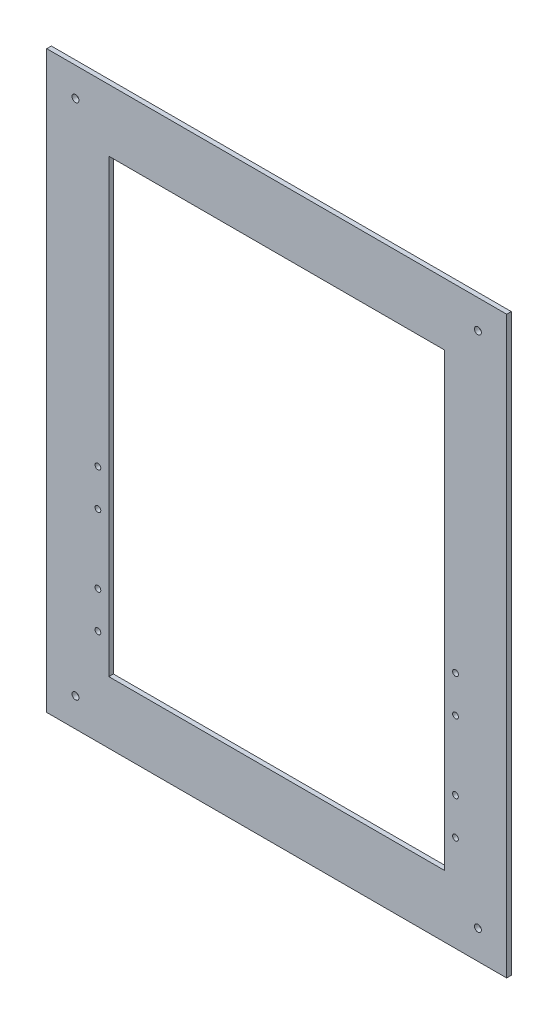
ISO-10303-21;
HEADER;
FILE_DESCRIPTION(('STEP AP214'),'2;1');
FILE_NAME('part.step','',(''),(''),'','','');
FILE_SCHEMA(('AUTOMOTIVE_DESIGN { 1 0 10303 214 1 1 1 1 }'));
ENDSEC;
DATA;
#1=APPLICATION_CONTEXT('core data for automotive mechanical design processes');
#2=APPLICATION_PROTOCOL_DEFINITION('international standard','automotive_design',2000,#1);
#3=PRODUCT_CONTEXT('',#1,'mechanical');
#4=PRODUCT('Part','Part','',(#3));
#5=PRODUCT_RELATED_PRODUCT_CATEGORY('part','',(#4));
#6=PRODUCT_DEFINITION_FORMATION('','',#4);
#7=PRODUCT_DEFINITION_CONTEXT('part definition',#1,'design');
#8=PRODUCT_DEFINITION('design','',#6,#7);
#9=PRODUCT_DEFINITION_SHAPE('','',#8);
#10=(LENGTH_UNIT() NAMED_UNIT(*) SI_UNIT(.MILLI.,.METRE.));
#11=(NAMED_UNIT(*) PLANE_ANGLE_UNIT() SI_UNIT($,.RADIAN.));
#12=(NAMED_UNIT(*) SI_UNIT($,.STERADIAN.) SOLID_ANGLE_UNIT());
#13=UNCERTAINTY_MEASURE_WITH_UNIT(LENGTH_MEASURE(1.E-05),#10,'distance_accuracy_value','');
#14=(GEOMETRIC_REPRESENTATION_CONTEXT(3) GLOBAL_UNCERTAINTY_ASSIGNED_CONTEXT((#13)) GLOBAL_UNIT_ASSIGNED_CONTEXT((#10,
#11,#12)) REPRESENTATION_CONTEXT('',''));
#15=CARTESIAN_POINT('',(0.,0.,0.));
#16=DIRECTION('',(0.,0.,1.));
#17=DIRECTION('',(1.,0.,0.));
#18=AXIS2_PLACEMENT_3D('',#15,#16,#17);
#19=CARTESIAN_POINT('',(0.,0.,4.));
#20=DIRECTION('',(0.,0.,-1.));
#21=DIRECTION('',(-1.,0.,0.));
#22=AXIS2_PLACEMENT_3D('',#19,#20,#21);
#23=PLANE('',#22);
#24=CARTESIAN_POINT('',(25.,475.,4.));
#25=DIRECTION('',(0.,0.,1.));
#26=DIRECTION('',(1.,0.,0.));
#27=AXIS2_PLACEMENT_3D('',#24,#25,#26);
#28=CIRCLE('',#27,2.99999999999999);
#29=CARTESIAN_POINT('',(28.,475.,4.));
#30=VERTEX_POINT('',#29);
#31=EDGE_CURVE('E274',#30,#30,#28,.F.);
#32=ORIENTED_EDGE('',*,*,#31,.T.);
#33=EDGE_LOOP('',(#32));
#34=FACE_BOUND('',#33,.T.);
#35=CARTESIAN_POINT('',(375.000000000001,475.,4.));
#36=DIRECTION('',(0.,0.,1.));
#37=DIRECTION('',(1.,0.,0.));
#38=AXIS2_PLACEMENT_3D('',#35,#36,#37);
#39=CIRCLE('',#38,2.99999999999999);
#40=CARTESIAN_POINT('',(378.000000000001,475.,4.));
#41=VERTEX_POINT('',#40);
#42=EDGE_CURVE('E268',#41,#41,#39,.T.);
#43=ORIENTED_EDGE('',*,*,#42,.F.);
#44=EDGE_LOOP('',(#43));
#45=FACE_BOUND('',#44,.T.);
#46=CARTESIAN_POINT('',(44.4999999999999,175.5,4.));
#47=DIRECTION('',(0.,0.,-1.));
#48=DIRECTION('',(-1.,0.,0.));
#49=AXIS2_PLACEMENT_3D('',#46,#47,#48);
#50=CIRCLE('',#49,2.50000000000002);
#51=CARTESIAN_POINT('',(41.9999999999999,175.5,4.));
#52=VERTEX_POINT('',#51);
#53=EDGE_CURVE('E258',#52,#52,#50,.T.);
#54=ORIENTED_EDGE('',*,*,#53,.T.);
#55=EDGE_LOOP('',(#54));
#56=FACE_BOUND('',#55,.T.);
#57=CARTESIAN_POINT('',(44.4999999999999,83.5,4.));
#58=DIRECTION('',(0.,0.,-1.));
#59=DIRECTION('',(-1.,0.,0.));
#60=AXIS2_PLACEMENT_3D('',#57,#58,#59);
#61=CIRCLE('',#60,2.50000000000002);
#62=CARTESIAN_POINT('',(41.9999999999999,83.5,4.));
#63=VERTEX_POINT('',#62);
#64=EDGE_CURVE('E246',#63,#63,#61,.T.);
#65=ORIENTED_EDGE('',*,*,#64,.T.);
#66=EDGE_LOOP('',(#65));
#67=FACE_BOUND('',#66,.T.);
#68=CARTESIAN_POINT('',(355.5,207.5,4.));
#69=DIRECTION('',(0.,0.,1.));
#70=DIRECTION('',(1.,0.,0.));
#71=AXIS2_PLACEMENT_3D('',#68,#69,#70);
#72=CIRCLE('',#71,2.50000000000002);
#73=CARTESIAN_POINT('',(358.,207.5,4.));
#74=VERTEX_POINT('',#73);
#75=EDGE_CURVE('E240',#74,#74,#72,.T.);
#76=ORIENTED_EDGE('',*,*,#75,.F.);
#77=EDGE_LOOP('',(#76));
#78=FACE_BOUND('',#77,.T.);
#79=CARTESIAN_POINT('',(355.5,175.5,4.));
#80=DIRECTION('',(0.,0.,1.));
#81=DIRECTION('',(1.,0.,0.));
#82=AXIS2_PLACEMENT_3D('',#79,#80,#81);
#83=CIRCLE('',#82,2.50000000000002);
#84=CARTESIAN_POINT('',(358.,175.5,4.));
#85=VERTEX_POINT('',#84);
#86=EDGE_CURVE('E234',#85,#85,#83,.T.);
#87=ORIENTED_EDGE('',*,*,#86,.F.);
#88=EDGE_LOOP('',(#87));
#89=FACE_BOUND('',#88,.T.);
#90=CARTESIAN_POINT('',(355.5,115.5,4.));
#91=DIRECTION('',(0.,0.,1.));
#92=DIRECTION('',(1.,0.,0.));
#93=AXIS2_PLACEMENT_3D('',#90,#91,#92);
#94=CIRCLE('',#93,2.50000000000002);
#95=CARTESIAN_POINT('',(358.,115.5,4.));
#96=VERTEX_POINT('',#95);
#97=EDGE_CURVE('E228',#96,#96,#94,.T.);
#98=ORIENTED_EDGE('',*,*,#97,.F.);
#99=EDGE_LOOP('',(#98));
#100=FACE_BOUND('',#99,.T.);
#101=CARTESIAN_POINT('',(355.5,83.5,4.));
#102=DIRECTION('',(0.,0.,1.));
#103=DIRECTION('',(1.,0.,0.));
#104=AXIS2_PLACEMENT_3D('',#101,#102,#103);
#105=CIRCLE('',#104,2.50000000000002);
#106=CARTESIAN_POINT('',(358.,83.5,4.));
#107=VERTEX_POINT('',#106);
#108=EDGE_CURVE('E125',#107,#107,#105,.T.);
#109=ORIENTED_EDGE('',*,*,#108,.F.);
#110=EDGE_LOOP('',(#109));
#111=FACE_BOUND('',#110,.T.);
#112=DIRECTION('',(0.,1.,0.));
#113=VECTOR('',#112,1.);
#114=CARTESIAN_POINT('',(346.,446.,4.));
#115=LINE('',#114,#113);
#116=CARTESIAN_POINT('',(346.,54.,4.));
#117=VERTEX_POINT('',#116);
#118=CARTESIAN_POINT('',(346.,446.,4.));
#119=VERTEX_POINT('',#118);
#120=EDGE_CURVE('E48',#117,#119,#115,.T.);
#121=ORIENTED_EDGE('',*,*,#120,.F.);
#122=DIRECTION('',(1.,0.,0.));
#123=VECTOR('',#122,1.);
#124=CARTESIAN_POINT('',(54.,54.,4.));
#125=LINE('',#124,#123);
#126=CARTESIAN_POINT('',(54.,54.,4.));
#127=VERTEX_POINT('',#126);
#128=EDGE_CURVE('E214',#127,#117,#125,.T.);
#129=ORIENTED_EDGE('',*,*,#128,.F.);
#130=DIRECTION('',(0.,-1.,0.));
#131=VECTOR('',#130,1.);
#132=CARTESIAN_POINT('',(54.,446.,4.));
#133=LINE('',#132,#131);
#134=CARTESIAN_POINT('',(54.,446.,4.));
#135=VERTEX_POINT('',#134);
#136=EDGE_CURVE('E116',#135,#127,#133,.T.);
#137=ORIENTED_EDGE('',*,*,#136,.F.);
#138=DIRECTION('',(-1.,0.,0.));
#139=VECTOR('',#138,1.);
#140=CARTESIAN_POINT('',(54.,446.,4.));
#141=LINE('',#140,#139);
#142=EDGE_CURVE('E133',#119,#135,#141,.T.);
#143=ORIENTED_EDGE('',*,*,#142,.F.);
#144=EDGE_LOOP('',(#121,#129,#137,#143));
#145=FACE_BOUND('',#144,.T.);
#146=DIRECTION('',(0.,-1.,0.));
#147=VECTOR('',#146,1.);
#148=CARTESIAN_POINT('',(0.,0.,4.));
#149=LINE('',#148,#147);
#150=CARTESIAN_POINT('',(0.,500.,4.));
#151=VERTEX_POINT('',#150);
#152=CARTESIAN_POINT('',(0.,0.,4.));
#153=VERTEX_POINT('',#152);
#154=EDGE_CURVE('E134',#151,#153,#149,.T.);
#155=ORIENTED_EDGE('',*,*,#154,.T.);
#156=DIRECTION('',(1.,0.,0.));
#157=VECTOR('',#156,1.);
#158=CARTESIAN_POINT('',(0.,0.,4.));
#159=LINE('',#158,#157);
#160=CARTESIAN_POINT('',(400.,0.,4.));
#161=VERTEX_POINT('',#160);
#162=EDGE_CURVE('E137',#153,#161,#159,.T.);
#163=ORIENTED_EDGE('',*,*,#162,.T.);
#164=DIRECTION('',(0.,1.,0.));
#165=VECTOR('',#164,1.);
#166=CARTESIAN_POINT('',(400.,0.,4.));
#167=LINE('',#166,#165);
#168=CARTESIAN_POINT('',(400.,500.,4.));
#169=VERTEX_POINT('',#168);
#170=EDGE_CURVE('E140',#161,#169,#167,.T.);
#171=ORIENTED_EDGE('',*,*,#170,.T.);
#172=DIRECTION('',(-1.,0.,0.));
#173=VECTOR('',#172,1.);
#174=CARTESIAN_POINT('',(0.,500.,4.));
#175=LINE('',#174,#173);
#176=EDGE_CURVE('E142',#169,#151,#175,.T.);
#177=ORIENTED_EDGE('',*,*,#176,.T.);
#178=EDGE_LOOP('',(#155,#163,#171,#177));
#179=FACE_BOUND('',#178,.T.);
#180=CARTESIAN_POINT('',(44.4999999999999,115.5,4.));
#181=DIRECTION('',(0.,0.,-1.));
#182=DIRECTION('',(-1.,0.,0.));
#183=AXIS2_PLACEMENT_3D('',#180,#181,#182);
#184=CIRCLE('',#183,2.50000000000002);
#185=CARTESIAN_POINT('',(41.9999999999999,115.5,4.));
#186=VERTEX_POINT('',#185);
#187=EDGE_CURVE('E252',#186,#186,#184,.T.);
#188=ORIENTED_EDGE('',*,*,#187,.T.);
#189=EDGE_LOOP('',(#188));
#190=FACE_BOUND('',#189,.T.);
#191=CARTESIAN_POINT('',(44.4999999999999,207.5,4.));
#192=DIRECTION('',(0.,0.,-1.));
#193=DIRECTION('',(-1.,0.,0.));
#194=AXIS2_PLACEMENT_3D('',#191,#192,#193);
#195=CIRCLE('',#194,2.50000000000002);
#196=CARTESIAN_POINT('',(41.9999999999999,207.5,4.));
#197=VERTEX_POINT('',#196);
#198=EDGE_CURVE('E264',#197,#197,#195,.T.);
#199=ORIENTED_EDGE('',*,*,#198,.T.);
#200=EDGE_LOOP('',(#199));
#201=FACE_BOUND('',#200,.T.);
#202=CARTESIAN_POINT('',(25.,25.,4.));
#203=DIRECTION('',(0.,0.,1.));
#204=DIRECTION('',(1.,0.,0.));
#205=AXIS2_PLACEMENT_3D('',#202,#203,#204);
#206=CIRCLE('',#205,2.99999999999999);
#207=CARTESIAN_POINT('',(28.,25.,4.));
#208=VERTEX_POINT('',#207);
#209=EDGE_CURVE('E279',#208,#208,#206,.T.);
#210=ORIENTED_EDGE('',*,*,#209,.F.);
#211=EDGE_LOOP('',(#210));
#212=FACE_BOUND('',#211,.T.);
#213=CARTESIAN_POINT('',(375.,24.9999999999996,4.));
#214=DIRECTION('',(0.,0.,1.));
#215=DIRECTION('',(1.,0.,0.));
#216=AXIS2_PLACEMENT_3D('',#213,#214,#215);
#217=CIRCLE('',#216,2.99999999999999);
#218=CARTESIAN_POINT('',(378.,24.9999999999996,4.));
#219=VERTEX_POINT('',#218);
#220=EDGE_CURVE('E285',#219,#219,#217,.F.);
#221=ORIENTED_EDGE('',*,*,#220,.T.);
#222=EDGE_LOOP('',(#221));
#223=FACE_BOUND('',#222,.T.);
#224=ADVANCED_FACE('F33',(#34,#45,#56,#67,#78,#89,#100,#111,#145,#179,#190,#201,#212,#223),#23,.F.);
#225=CARTESIAN_POINT('',(0.,0.,0.));
#226=DIRECTION('',(0.,0.,-1.));
#227=DIRECTION('',(-1.,0.,0.));
#228=AXIS2_PLACEMENT_3D('',#225,#226,#227);
#229=PLANE('',#228);
#230=CARTESIAN_POINT('',(25.,475.,0.));
#231=DIRECTION('',(0.,0.,1.));
#232=DIRECTION('',(1.,0.,0.));
#233=AXIS2_PLACEMENT_3D('',#230,#231,#232);
#234=CIRCLE('',#233,2.99999999999999);
#235=CARTESIAN_POINT('',(28.,475.,0.));
#236=VERTEX_POINT('',#235);
#237=EDGE_CURVE('E271',#236,#236,#234,.F.);
#238=ORIENTED_EDGE('',*,*,#237,.F.);
#239=EDGE_LOOP('',(#238));
#240=FACE_BOUND('',#239,.T.);
#241=CARTESIAN_POINT('',(375.000000000001,475.,0.));
#242=DIRECTION('',(0.,0.,1.));
#243=DIRECTION('',(1.,0.,0.));
#244=AXIS2_PLACEMENT_3D('',#241,#242,#243);
#245=CIRCLE('',#244,2.99999999999999);
#246=CARTESIAN_POINT('',(378.000000000001,475.,0.));
#247=VERTEX_POINT('',#246);
#248=EDGE_CURVE('E267',#247,#247,#245,.T.);
#249=ORIENTED_EDGE('',*,*,#248,.T.);
#250=EDGE_LOOP('',(#249));
#251=FACE_BOUND('',#250,.T.);
#252=CARTESIAN_POINT('',(44.4999999999999,175.5,0.));
#253=DIRECTION('',(0.,0.,-1.));
#254=DIRECTION('',(-1.,0.,0.));
#255=AXIS2_PLACEMENT_3D('',#252,#253,#254);
#256=CIRCLE('',#255,2.50000000000002);
#257=CARTESIAN_POINT('',(41.9999999999999,175.5,0.));
#258=VERTEX_POINT('',#257);
#259=EDGE_CURVE('E255',#258,#258,#256,.T.);
#260=ORIENTED_EDGE('',*,*,#259,.F.);
#261=EDGE_LOOP('',(#260));
#262=FACE_BOUND('',#261,.T.);
#263=CARTESIAN_POINT('',(44.4999999999999,83.5,0.));
#264=DIRECTION('',(0.,0.,-1.));
#265=DIRECTION('',(-1.,0.,0.));
#266=AXIS2_PLACEMENT_3D('',#263,#264,#265);
#267=CIRCLE('',#266,2.50000000000002);
#268=CARTESIAN_POINT('',(41.9999999999999,83.5,0.));
#269=VERTEX_POINT('',#268);
#270=EDGE_CURVE('E243',#269,#269,#267,.T.);
#271=ORIENTED_EDGE('',*,*,#270,.F.);
#272=EDGE_LOOP('',(#271));
#273=FACE_BOUND('',#272,.T.);
#274=CARTESIAN_POINT('',(355.5,207.5,0.));
#275=DIRECTION('',(0.,0.,-1.));
#276=DIRECTION('',(-1.,0.,0.));
#277=AXIS2_PLACEMENT_3D('',#274,#275,#276);
#278=CIRCLE('',#277,2.50000000000002);
#279=CARTESIAN_POINT('',(353.,207.5,0.));
#280=VERTEX_POINT('',#279);
#281=EDGE_CURVE('E237',#280,#280,#278,.F.);
#282=ORIENTED_EDGE('',*,*,#281,.T.);
#283=EDGE_LOOP('',(#282));
#284=FACE_BOUND('',#283,.T.);
#285=CARTESIAN_POINT('',(355.5,175.5,0.));
#286=DIRECTION('',(0.,0.,-1.));
#287=DIRECTION('',(-1.,0.,0.));
#288=AXIS2_PLACEMENT_3D('',#285,#286,#287);
#289=CIRCLE('',#288,2.50000000000002);
#290=CARTESIAN_POINT('',(353.,175.5,0.));
#291=VERTEX_POINT('',#290);
#292=EDGE_CURVE('E231',#291,#291,#289,.F.);
#293=ORIENTED_EDGE('',*,*,#292,.T.);
#294=EDGE_LOOP('',(#293));
#295=FACE_BOUND('',#294,.T.);
#296=CARTESIAN_POINT('',(355.5,115.5,0.));
#297=DIRECTION('',(0.,0.,-1.));
#298=DIRECTION('',(-1.,0.,0.));
#299=AXIS2_PLACEMENT_3D('',#296,#297,#298);
#300=CIRCLE('',#299,2.50000000000002);
#301=CARTESIAN_POINT('',(353.,115.5,0.));
#302=VERTEX_POINT('',#301);
#303=EDGE_CURVE('E225',#302,#302,#300,.F.);
#304=ORIENTED_EDGE('',*,*,#303,.T.);
#305=EDGE_LOOP('',(#304));
#306=FACE_BOUND('',#305,.T.);
#307=CARTESIAN_POINT('',(355.5,83.5,0.));
#308=DIRECTION('',(0.,0.,-1.));
#309=DIRECTION('',(-1.,0.,0.));
#310=AXIS2_PLACEMENT_3D('',#307,#308,#309);
#311=CIRCLE('',#310,2.50000000000002);
#312=CARTESIAN_POINT('',(353.,83.5,0.));
#313=VERTEX_POINT('',#312);
#314=EDGE_CURVE('E122',#313,#313,#311,.F.);
#315=ORIENTED_EDGE('',*,*,#314,.T.);
#316=EDGE_LOOP('',(#315));
#317=FACE_BOUND('',#316,.T.);
#318=DIRECTION('',(1.,0.,0.));
#319=VECTOR('',#318,1.);
#320=CARTESIAN_POINT('',(54.,54.,0.));
#321=LINE('',#320,#319);
#322=CARTESIAN_POINT('',(54.,54.,-1.13686837721616E-10));
#323=VERTEX_POINT('',#322);
#324=CARTESIAN_POINT('',(346.,54.,-1.13686837721616E-10));
#325=VERTEX_POINT('',#324);
#326=EDGE_CURVE('E99',#323,#325,#321,.T.);
#327=ORIENTED_EDGE('',*,*,#326,.T.);
#328=DIRECTION('',(0.,1.,0.));
#329=VECTOR('',#328,1.);
#330=CARTESIAN_POINT('',(346.,446.,0.));
#331=LINE('',#330,#329);
#332=CARTESIAN_POINT('',(346.,446.,-1.13686837721616E-10));
#333=VERTEX_POINT('',#332);
#334=EDGE_CURVE('E109',#325,#333,#331,.T.);
#335=ORIENTED_EDGE('',*,*,#334,.T.);
#336=DIRECTION('',(-1.,0.,0.));
#337=VECTOR('',#336,1.);
#338=CARTESIAN_POINT('',(54.,446.,0.));
#339=LINE('',#338,#337);
#340=CARTESIAN_POINT('',(54.,446.,0.));
#341=VERTEX_POINT('',#340);
#342=EDGE_CURVE('E118',#333,#341,#339,.T.);
#343=ORIENTED_EDGE('',*,*,#342,.T.);
#344=DIRECTION('',(0.,-1.,0.));
#345=VECTOR('',#344,1.);
#346=CARTESIAN_POINT('',(54.,446.,0.));
#347=LINE('',#346,#345);
#348=EDGE_CURVE('E110',#341,#323,#347,.T.);
#349=ORIENTED_EDGE('',*,*,#348,.T.);
#350=EDGE_LOOP('',(#327,#335,#343,#349));
#351=FACE_BOUND('',#350,.T.);
#352=DIRECTION('',(0.,-1.,0.));
#353=VECTOR('',#352,1.);
#354=CARTESIAN_POINT('',(0.,0.,0.));
#355=LINE('',#354,#353);
#356=CARTESIAN_POINT('',(0.,500.,0.));
#357=VERTEX_POINT('',#356);
#358=CARTESIAN_POINT('',(0.,0.,0.));
#359=VERTEX_POINT('',#358);
#360=EDGE_CURVE('E145',#357,#359,#355,.T.);
#361=ORIENTED_EDGE('',*,*,#360,.F.);
#362=DIRECTION('',(-1.,0.,0.));
#363=VECTOR('',#362,1.);
#364=CARTESIAN_POINT('',(0.,500.,0.));
#365=LINE('',#364,#363);
#366=CARTESIAN_POINT('',(400.,500.,0.));
#367=VERTEX_POINT('',#366);
#368=EDGE_CURVE('E138',#367,#357,#365,.T.);
#369=ORIENTED_EDGE('',*,*,#368,.F.);
#370=DIRECTION('',(0.,1.,0.));
#371=VECTOR('',#370,1.);
#372=CARTESIAN_POINT('',(400.,0.,0.));
#373=LINE('',#372,#371);
#374=CARTESIAN_POINT('',(400.,0.,0.));
#375=VERTEX_POINT('',#374);
#376=EDGE_CURVE('E150',#375,#367,#373,.T.);
#377=ORIENTED_EDGE('',*,*,#376,.F.);
#378=DIRECTION('',(1.,0.,0.));
#379=VECTOR('',#378,1.);
#380=CARTESIAN_POINT('',(0.,0.,0.));
#381=LINE('',#380,#379);
#382=EDGE_CURVE('E148',#359,#375,#381,.T.);
#383=ORIENTED_EDGE('',*,*,#382,.F.);
#384=EDGE_LOOP('',(#361,#369,#377,#383));
#385=FACE_BOUND('',#384,.T.);
#386=CARTESIAN_POINT('',(44.4999999999999,115.5,0.));
#387=DIRECTION('',(0.,0.,-1.));
#388=DIRECTION('',(-1.,0.,0.));
#389=AXIS2_PLACEMENT_3D('',#386,#387,#388);
#390=CIRCLE('',#389,2.50000000000002);
#391=CARTESIAN_POINT('',(41.9999999999999,115.5,0.));
#392=VERTEX_POINT('',#391);
#393=EDGE_CURVE('E249',#392,#392,#390,.T.);
#394=ORIENTED_EDGE('',*,*,#393,.F.);
#395=EDGE_LOOP('',(#394));
#396=FACE_BOUND('',#395,.T.);
#397=CARTESIAN_POINT('',(44.4999999999999,207.5,0.));
#398=DIRECTION('',(0.,0.,-1.));
#399=DIRECTION('',(-1.,0.,0.));
#400=AXIS2_PLACEMENT_3D('',#397,#398,#399);
#401=CIRCLE('',#400,2.50000000000002);
#402=CARTESIAN_POINT('',(41.9999999999999,207.5,0.));
#403=VERTEX_POINT('',#402);
#404=EDGE_CURVE('E261',#403,#403,#401,.T.);
#405=ORIENTED_EDGE('',*,*,#404,.F.);
#406=EDGE_LOOP('',(#405));
#407=FACE_BOUND('',#406,.T.);
#408=CARTESIAN_POINT('',(25.,25.,0.));
#409=DIRECTION('',(0.,0.,1.));
#410=DIRECTION('',(1.,0.,0.));
#411=AXIS2_PLACEMENT_3D('',#408,#409,#410);
#412=CIRCLE('',#411,2.99999999999999);
#413=CARTESIAN_POINT('',(28.,25.,0.));
#414=VERTEX_POINT('',#413);
#415=EDGE_CURVE('E276',#414,#414,#412,.T.);
#416=ORIENTED_EDGE('',*,*,#415,.T.);
#417=EDGE_LOOP('',(#416));
#418=FACE_BOUND('',#417,.T.);
#419=CARTESIAN_POINT('',(375.,24.9999999999996,0.));
#420=DIRECTION('',(0.,0.,1.));
#421=DIRECTION('',(1.,0.,0.));
#422=AXIS2_PLACEMENT_3D('',#419,#420,#421);
#423=CIRCLE('',#422,2.99999999999999);
#424=CARTESIAN_POINT('',(378.,24.9999999999996,0.));
#425=VERTEX_POINT('',#424);
#426=EDGE_CURVE('E282',#425,#425,#423,.F.);
#427=ORIENTED_EDGE('',*,*,#426,.F.);
#428=EDGE_LOOP('',(#427));
#429=FACE_BOUND('',#428,.T.);
#430=ADVANCED_FACE('F120',(#240,#251,#262,#273,#284,#295,#306,#317,#351,#385,#396,#407,#418,
#429),#229,.T.);
#431=CARTESIAN_POINT('',(0.,0.,4.));
#432=DIRECTION('',(1.,0.,0.));
#433=DIRECTION('',(0.,0.,-1.));
#434=AXIS2_PLACEMENT_3D('',#431,#432,#433);
#435=PLANE('',#434);
#436=ORIENTED_EDGE('',*,*,#360,.T.);
#437=DIRECTION('',(0.,0.,-1.));
#438=VECTOR('',#437,1.);
#439=CARTESIAN_POINT('',(0.,0.,4.));
#440=LINE('',#439,#438);
#441=EDGE_CURVE('E11',#153,#359,#440,.T.);
#442=ORIENTED_EDGE('',*,*,#441,.F.);
#443=ORIENTED_EDGE('',*,*,#154,.F.);
#444=DIRECTION('',(0.,0.,-1.));
#445=VECTOR('',#444,1.);
#446=CARTESIAN_POINT('',(0.,500.,4.));
#447=LINE('',#446,#445);
#448=EDGE_CURVE('E144',#151,#357,#447,.T.);
#449=ORIENTED_EDGE('',*,*,#448,.T.);
#450=EDGE_LOOP('',(#436,#442,#443,#449));
#451=FACE_BOUND('',#450,.T.);
#452=ADVANCED_FACE('F35',(#451),#435,.F.);
#453=CARTESIAN_POINT('',(0.,0.,4.));
#454=DIRECTION('',(0.,1.,0.));
#455=DIRECTION('',(0.,0.,1.));
#456=AXIS2_PLACEMENT_3D('',#453,#454,#455);
#457=PLANE('',#456);
#458=ORIENTED_EDGE('',*,*,#382,.T.);
#459=DIRECTION('',(0.,0.,-1.));
#460=VECTOR('',#459,1.);
#461=CARTESIAN_POINT('',(400.,0.,4.));
#462=LINE('',#461,#460);
#463=EDGE_CURVE('E41',#161,#375,#462,.T.);
#464=ORIENTED_EDGE('',*,*,#463,.F.);
#465=ORIENTED_EDGE('',*,*,#162,.F.);
#466=ORIENTED_EDGE('',*,*,#441,.T.);
#467=EDGE_LOOP('',(#458,#464,#465,#466));
#468=FACE_BOUND('',#467,.T.);
#469=ADVANCED_FACE('F177',(#468),#457,.F.);
#470=CARTESIAN_POINT('',(400.,0.,4.));
#471=DIRECTION('',(-1.,0.,0.));
#472=DIRECTION('',(0.,0.,1.));
#473=AXIS2_PLACEMENT_3D('',#470,#471,#472);
#474=PLANE('',#473);
#475=ORIENTED_EDGE('',*,*,#376,.T.);
#476=DIRECTION('',(0.,0.,-1.));
#477=VECTOR('',#476,1.);
#478=CARTESIAN_POINT('',(400.,500.,4.));
#479=LINE('',#478,#477);
#480=EDGE_CURVE('E155',#169,#367,#479,.T.);
#481=ORIENTED_EDGE('',*,*,#480,.F.);
#482=ORIENTED_EDGE('',*,*,#170,.F.);
#483=ORIENTED_EDGE('',*,*,#463,.T.);
#484=EDGE_LOOP('',(#475,#481,#482,#483));
#485=FACE_BOUND('',#484,.T.);
#486=ADVANCED_FACE('F162',(#485),#474,.F.);
#487=CARTESIAN_POINT('',(0.,500.,4.));
#488=DIRECTION('',(0.,-1.,0.));
#489=DIRECTION('',(0.,0.,-1.));
#490=AXIS2_PLACEMENT_3D('',#487,#488,#489);
#491=PLANE('',#490);
#492=ORIENTED_EDGE('',*,*,#368,.T.);
#493=ORIENTED_EDGE('',*,*,#448,.F.);
#494=ORIENTED_EDGE('',*,*,#176,.F.);
#495=ORIENTED_EDGE('',*,*,#480,.T.);
#496=EDGE_LOOP('',(#492,#493,#494,#495));
#497=FACE_BOUND('',#496,.T.);
#498=ADVANCED_FACE('F170',(#497),#491,.F.);
#499=CARTESIAN_POINT('',(54.,54.,-500000.));
#500=DIRECTION('',(0.,-1.,0.));
#501=DIRECTION('',(0.,0.,-1.));
#502=AXIS2_PLACEMENT_3D('',#499,#500,#501);
#503=PLANE('',#502);
#504=DIRECTION('',(0.,0.,1.));
#505=VECTOR('',#504,1.);
#506=CARTESIAN_POINT('',(54.,54.,-500000.));
#507=LINE('',#506,#505);
#508=EDGE_CURVE('E103',#323,#127,#507,.T.);
#509=ORIENTED_EDGE('',*,*,#508,.T.);
#510=ORIENTED_EDGE('',*,*,#128,.T.);
#511=DIRECTION('',(0.,0.,1.));
#512=VECTOR('',#511,1.);
#513=CARTESIAN_POINT('',(346.,54.,-500000.));
#514=LINE('',#513,#512);
#515=EDGE_CURVE('E105',#325,#117,#514,.T.);
#516=ORIENTED_EDGE('',*,*,#515,.F.);
#517=ORIENTED_EDGE('',*,*,#326,.F.);
#518=EDGE_LOOP('',(#509,#510,#516,#517));
#519=FACE_BOUND('',#518,.T.);
#520=ADVANCED_FACE('F101',(#519),#503,.F.);
#521=CARTESIAN_POINT('',(54.,446.,-500000.));
#522=DIRECTION('',(-1.,0.,0.));
#523=DIRECTION('',(0.,-1.,0.));
#524=AXIS2_PLACEMENT_3D('',#521,#522,#523);
#525=PLANE('',#524);
#526=DIRECTION('',(0.,0.,1.));
#527=VECTOR('',#526,1.);
#528=CARTESIAN_POINT('',(54.,446.,-500000.));
#529=LINE('',#528,#527);
#530=EDGE_CURVE('E56',#341,#135,#529,.T.);
#531=ORIENTED_EDGE('',*,*,#530,.T.);
#532=ORIENTED_EDGE('',*,*,#136,.T.);
#533=ORIENTED_EDGE('',*,*,#508,.F.);
#534=ORIENTED_EDGE('',*,*,#348,.F.);
#535=EDGE_LOOP('',(#531,#532,#533,#534));
#536=FACE_BOUND('',#535,.T.);
#537=ADVANCED_FACE('F113',(#536),#525,.F.);
#538=CARTESIAN_POINT('',(346.,446.,-500000.));
#539=DIRECTION('',(1.,0.,0.));
#540=DIRECTION('',(0.,1.,0.));
#541=AXIS2_PLACEMENT_3D('',#538,#539,#540);
#542=PLANE('',#541);
#543=ORIENTED_EDGE('',*,*,#515,.T.);
#544=ORIENTED_EDGE('',*,*,#120,.T.);
#545=DIRECTION('',(0.,0.,1.));
#546=VECTOR('',#545,1.);
#547=CARTESIAN_POINT('',(346.,446.,-500000.));
#548=LINE('',#547,#546);
#549=EDGE_CURVE('E130',#333,#119,#548,.T.);
#550=ORIENTED_EDGE('',*,*,#549,.F.);
#551=ORIENTED_EDGE('',*,*,#334,.F.);
#552=EDGE_LOOP('',(#543,#544,#550,#551));
#553=FACE_BOUND('',#552,.T.);
#554=ADVANCED_FACE('F206',(#553),#542,.F.);
#555=CARTESIAN_POINT('',(54.,446.,-500000.));
#556=DIRECTION('',(0.,1.,0.));
#557=DIRECTION('',(0.,0.,1.));
#558=AXIS2_PLACEMENT_3D('',#555,#556,#557);
#559=PLANE('',#558);
#560=ORIENTED_EDGE('',*,*,#549,.T.);
#561=ORIENTED_EDGE('',*,*,#142,.T.);
#562=ORIENTED_EDGE('',*,*,#530,.F.);
#563=ORIENTED_EDGE('',*,*,#342,.F.);
#564=EDGE_LOOP('',(#560,#561,#562,#563));
#565=FACE_BOUND('',#564,.T.);
#566=ADVANCED_FACE('F195',(#565),#559,.F.);
#567=CARTESIAN_POINT('',(355.5,83.5,-7.07106781186552));
#568=DIRECTION('',(0.,0.,1.));
#569=DIRECTION('',(1.,0.,0.));
#570=AXIS2_PLACEMENT_3D('',#567,#568,#569);
#571=CYLINDRICAL_SURFACE('',#570,2.50000000000002);
#572=ORIENTED_EDGE('',*,*,#108,.T.);
#573=EDGE_LOOP('',(#572));
#574=FACE_BOUND('',#573,.T.);
#575=ORIENTED_EDGE('',*,*,#314,.F.);
#576=EDGE_LOOP('',(#575));
#577=FACE_BOUND('',#576,.T.);
#578=ADVANCED_FACE('F213',(#574,#577),#571,.F.);
#579=CARTESIAN_POINT('',(355.5,115.5,-7.07106781186552));
#580=DIRECTION('',(0.,0.,1.));
#581=DIRECTION('',(1.,0.,0.));
#582=AXIS2_PLACEMENT_3D('',#579,#580,#581);
#583=CYLINDRICAL_SURFACE('',#582,2.50000000000002);
#584=ORIENTED_EDGE('',*,*,#97,.T.);
#585=EDGE_LOOP('',(#584));
#586=FACE_BOUND('',#585,.T.);
#587=ORIENTED_EDGE('',*,*,#303,.F.);
#588=EDGE_LOOP('',(#587));
#589=FACE_BOUND('',#588,.T.);
#590=ADVANCED_FACE('F336',(#586,#589),#583,.F.);
#591=CARTESIAN_POINT('',(355.5,175.5,-7.07106781186552));
#592=DIRECTION('',(0.,0.,1.));
#593=DIRECTION('',(1.,0.,0.));
#594=AXIS2_PLACEMENT_3D('',#591,#592,#593);
#595=CYLINDRICAL_SURFACE('',#594,2.50000000000002);
#596=ORIENTED_EDGE('',*,*,#86,.T.);
#597=EDGE_LOOP('',(#596));
#598=FACE_BOUND('',#597,.T.);
#599=ORIENTED_EDGE('',*,*,#292,.F.);
#600=EDGE_LOOP('',(#599));
#601=FACE_BOUND('',#600,.T.);
#602=ADVANCED_FACE('F332',(#598,#601),#595,.F.);
#603=CARTESIAN_POINT('',(355.5,207.5,-7.07106781186552));
#604=DIRECTION('',(0.,0.,1.));
#605=DIRECTION('',(1.,0.,0.));
#606=AXIS2_PLACEMENT_3D('',#603,#604,#605);
#607=CYLINDRICAL_SURFACE('',#606,2.50000000000002);
#608=ORIENTED_EDGE('',*,*,#75,.T.);
#609=EDGE_LOOP('',(#608));
#610=FACE_BOUND('',#609,.T.);
#611=ORIENTED_EDGE('',*,*,#281,.F.);
#612=EDGE_LOOP('',(#611));
#613=FACE_BOUND('',#612,.T.);
#614=ADVANCED_FACE('F328',(#610,#613),#607,.F.);
#615=CARTESIAN_POINT('',(44.4999999999999,83.5,-7.07106781186555));
#616=DIRECTION('',(0.,0.,1.));
#617=DIRECTION('',(1.,0.,0.));
#618=AXIS2_PLACEMENT_3D('',#615,#616,#617);
#619=CYLINDRICAL_SURFACE('',#618,2.50000000000002);
#620=ORIENTED_EDGE('',*,*,#64,.F.);
#621=EDGE_LOOP('',(#620));
#622=FACE_BOUND('',#621,.T.);
#623=ORIENTED_EDGE('',*,*,#270,.T.);
#624=EDGE_LOOP('',(#623));
#625=FACE_BOUND('',#624,.T.);
#626=ADVANCED_FACE('F324',(#622,#625),#619,.F.);
#627=CARTESIAN_POINT('',(44.4999999999999,115.5,-7.07106781186555));
#628=DIRECTION('',(0.,0.,1.));
#629=DIRECTION('',(1.,0.,0.));
#630=AXIS2_PLACEMENT_3D('',#627,#628,#629);
#631=CYLINDRICAL_SURFACE('',#630,2.50000000000002);
#632=ORIENTED_EDGE('',*,*,#187,.F.);
#633=EDGE_LOOP('',(#632));
#634=FACE_BOUND('',#633,.T.);
#635=ORIENTED_EDGE('',*,*,#393,.T.);
#636=EDGE_LOOP('',(#635));
#637=FACE_BOUND('',#636,.T.);
#638=ADVANCED_FACE('F320',(#634,#637),#631,.F.);
#639=CARTESIAN_POINT('',(44.4999999999999,175.5,-7.07106781186555));
#640=DIRECTION('',(0.,0.,1.));
#641=DIRECTION('',(1.,0.,0.));
#642=AXIS2_PLACEMENT_3D('',#639,#640,#641);
#643=CYLINDRICAL_SURFACE('',#642,2.50000000000002);
#644=ORIENTED_EDGE('',*,*,#53,.F.);
#645=EDGE_LOOP('',(#644));
#646=FACE_BOUND('',#645,.T.);
#647=ORIENTED_EDGE('',*,*,#259,.T.);
#648=EDGE_LOOP('',(#647));
#649=FACE_BOUND('',#648,.T.);
#650=ADVANCED_FACE('F316',(#646,#649),#643,.F.);
#651=CARTESIAN_POINT('',(44.4999999999999,207.5,-7.07106781186555));
#652=DIRECTION('',(0.,0.,1.));
#653=DIRECTION('',(1.,0.,0.));
#654=AXIS2_PLACEMENT_3D('',#651,#652,#653);
#655=CYLINDRICAL_SURFACE('',#654,2.50000000000002);
#656=ORIENTED_EDGE('',*,*,#198,.F.);
#657=EDGE_LOOP('',(#656));
#658=FACE_BOUND('',#657,.T.);
#659=ORIENTED_EDGE('',*,*,#404,.T.);
#660=EDGE_LOOP('',(#659));
#661=FACE_BOUND('',#660,.T.);
#662=ADVANCED_FACE('F312',(#658,#661),#655,.F.);
#663=CARTESIAN_POINT('',(375.000000000001,475.,0.));
#664=DIRECTION('',(0.,0.,1.));
#665=DIRECTION('',(1.,0.,0.));
#666=AXIS2_PLACEMENT_3D('',#663,#664,#665);
#667=CYLINDRICAL_SURFACE('',#666,2.99999999999999);
#668=ORIENTED_EDGE('',*,*,#248,.F.);
#669=EDGE_LOOP('',(#668));
#670=FACE_BOUND('',#669,.T.);
#671=ORIENTED_EDGE('',*,*,#42,.T.);
#672=EDGE_LOOP('',(#671));
#673=FACE_BOUND('',#672,.T.);
#674=ADVANCED_FACE('F308',(#670,#673),#667,.F.);
#675=CARTESIAN_POINT('',(25.,475.,0.));
#676=DIRECTION('',(0.,0.,1.));
#677=DIRECTION('',(1.,0.,0.));
#678=AXIS2_PLACEMENT_3D('',#675,#676,#677);
#679=CYLINDRICAL_SURFACE('',#678,2.99999999999999);
#680=ORIENTED_EDGE('',*,*,#237,.T.);
#681=EDGE_LOOP('',(#680));
#682=FACE_BOUND('',#681,.T.);
#683=ORIENTED_EDGE('',*,*,#31,.F.);
#684=EDGE_LOOP('',(#683));
#685=FACE_BOUND('',#684,.T.);
#686=ADVANCED_FACE('F302',(#682,#685),#679,.F.);
#687=CARTESIAN_POINT('',(25.,25.,0.));
#688=DIRECTION('',(0.,0.,1.));
#689=DIRECTION('',(1.,0.,0.));
#690=AXIS2_PLACEMENT_3D('',#687,#688,#689);
#691=CYLINDRICAL_SURFACE('',#690,2.99999999999999);
#692=ORIENTED_EDGE('',*,*,#415,.F.);
#693=EDGE_LOOP('',(#692));
#694=FACE_BOUND('',#693,.T.);
#695=ORIENTED_EDGE('',*,*,#209,.T.);
#696=EDGE_LOOP('',(#695));
#697=FACE_BOUND('',#696,.T.);
#698=ADVANCED_FACE('F295',(#694,#697),#691,.F.);
#699=CARTESIAN_POINT('',(375.,24.9999999999996,0.));
#700=DIRECTION('',(0.,0.,1.));
#701=DIRECTION('',(1.,0.,0.));
#702=AXIS2_PLACEMENT_3D('',#699,#700,#701);
#703=CYLINDRICAL_SURFACE('',#702,2.99999999999999);
#704=ORIENTED_EDGE('',*,*,#426,.T.);
#705=EDGE_LOOP('',(#704));
#706=FACE_BOUND('',#705,.T.);
#707=ORIENTED_EDGE('',*,*,#220,.F.);
#708=EDGE_LOOP('',(#707));
#709=FACE_BOUND('',#708,.T.);
#710=ADVANCED_FACE('F291',(#706,#709),#703,.F.);
#711=CLOSED_SHELL('',(#224,#430,#452,#469,#486,#498,#520,#537,#554,#566,#578,#590,#602,#614,
#626,#638,#650,#662,#674,#686,#698,#710));
#712=MANIFOLD_SOLID_BREP('B2',#711);
#713=ADVANCED_BREP_SHAPE_REPRESENTATION('',(#18,#712),#14);
#714=SHAPE_DEFINITION_REPRESENTATION(#9,#713);
ENDSEC;
END-ISO-10303-21;
